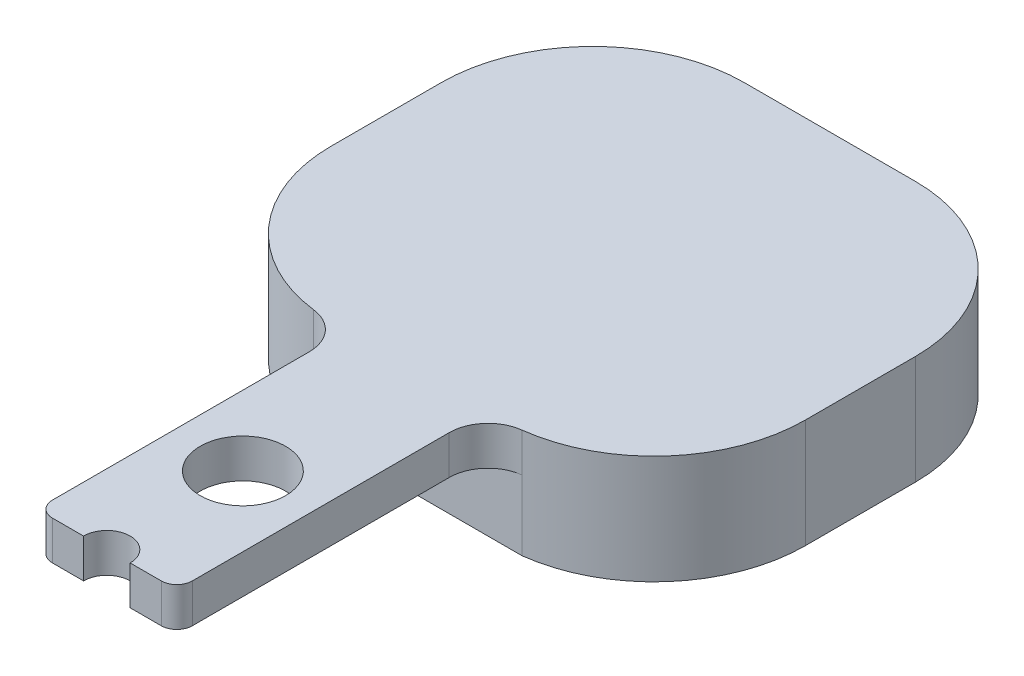
ISO-10303-21;
HEADER;
FILE_DESCRIPTION(('STEP AP214'),'2;1');
FILE_NAME('part.step','',(''),(''),'','','');
FILE_SCHEMA(('AUTOMOTIVE_DESIGN { 1 0 10303 214 1 1 1 1 }'));
ENDSEC;
DATA;
#1=APPLICATION_CONTEXT('core data for automotive mechanical design processes');
#2=APPLICATION_PROTOCOL_DEFINITION('international standard','automotive_design',2000,#1);
#3=PRODUCT_CONTEXT('',#1,'mechanical');
#4=PRODUCT('Part','Part','',(#3));
#5=PRODUCT_RELATED_PRODUCT_CATEGORY('part','',(#4));
#6=PRODUCT_DEFINITION_FORMATION('','',#4);
#7=PRODUCT_DEFINITION_CONTEXT('part definition',#1,'design');
#8=PRODUCT_DEFINITION('design','',#6,#7);
#9=PRODUCT_DEFINITION_SHAPE('','',#8);
#10=(LENGTH_UNIT() NAMED_UNIT(*) SI_UNIT(.MILLI.,.METRE.));
#11=(NAMED_UNIT(*) PLANE_ANGLE_UNIT() SI_UNIT($,.RADIAN.));
#12=(NAMED_UNIT(*) SI_UNIT($,.STERADIAN.) SOLID_ANGLE_UNIT());
#13=UNCERTAINTY_MEASURE_WITH_UNIT(LENGTH_MEASURE(1.E-05),#10,'distance_accuracy_value','');
#14=(GEOMETRIC_REPRESENTATION_CONTEXT(3) GLOBAL_UNCERTAINTY_ASSIGNED_CONTEXT((#13)) GLOBAL_UNIT_ASSIGNED_CONTEXT((#10,
#11,#12)) REPRESENTATION_CONTEXT('',''));
#15=CARTESIAN_POINT('',(0.,0.,0.));
#16=DIRECTION('',(0.,0.,1.));
#17=DIRECTION('',(1.,0.,0.));
#18=AXIS2_PLACEMENT_3D('',#15,#16,#17);
#19=CARTESIAN_POINT('',(2.98004344828693,2.5,22.6380329202358));
#20=DIRECTION('',(0.,-1.,0.));
#21=DIRECTION('',(0.,0.,-1.));
#22=AXIS2_PLACEMENT_3D('',#19,#20,#21);
#23=CYLINDRICAL_SURFACE('',#22,2.75);
#24=CARTESIAN_POINT('',(2.98004344828693,2.5,22.6380329202358));
#25=DIRECTION('',(0.,1.,0.));
#26=DIRECTION('',(1.,0.,0.));
#27=AXIS2_PLACEMENT_3D('',#24,#25,#26);
#28=CIRCLE('',#27,2.75);
#29=CARTESIAN_POINT('',(5.73004344828693,2.5,22.6380329202358));
#30=VERTEX_POINT('',#29);
#31=EDGE_CURVE('E11',#30,#30,#28,.T.);
#32=ORIENTED_EDGE('',*,*,#31,.T.);
#33=EDGE_LOOP('',(#32));
#34=FACE_BOUND('',#33,.T.);
#35=CARTESIAN_POINT('',(2.98004344828693,0.,22.6380329202358));
#36=DIRECTION('',(0.,1.,0.));
#37=DIRECTION('',(1.,0.,0.));
#38=AXIS2_PLACEMENT_3D('',#35,#36,#37);
#39=CIRCLE('',#38,2.75);
#40=CARTESIAN_POINT('',(5.73004344828693,0.,22.6380329202358));
#41=VERTEX_POINT('',#40);
#42=EDGE_CURVE('E236',#41,#41,#39,.T.);
#43=ORIENTED_EDGE('',*,*,#42,.F.);
#44=EDGE_LOOP('',(#43));
#45=FACE_BOUND('',#44,.T.);
#46=ADVANCED_FACE('F16',(#34,#45),#23,.F.);
#47=CARTESIAN_POINT('',(2.98004344828693,2.5,31.3880329202358));
#48=DIRECTION('',(0.,-1.,0.));
#49=DIRECTION('',(0.,0.,-1.));
#50=AXIS2_PLACEMENT_3D('',#47,#48,#49);
#51=CYLINDRICAL_SURFACE('',#50,1.5);
#52=CARTESIAN_POINT('',(2.98004344828693,2.5,31.3880329202358));
#53=DIRECTION('',(0.,-1.,0.));
#54=DIRECTION('',(0.,0.,-1.));
#55=AXIS2_PLACEMENT_3D('',#52,#53,#54);
#56=CIRCLE('',#55,1.5);
#57=CARTESIAN_POINT('',(1.48004344828693,2.5,31.3880329202358));
#58=VERTEX_POINT('',#57);
#59=CARTESIAN_POINT('',(4.48004344828693,2.5,31.3880329202358));
#60=VERTEX_POINT('',#59);
#61=EDGE_CURVE('E35',#58,#60,#56,.T.);
#62=ORIENTED_EDGE('',*,*,#61,.F.);
#63=DIRECTION('',(0.,-1.,0.));
#64=VECTOR('',#63,1.);
#65=CARTESIAN_POINT('',(1.48004344828693,2.5,31.3880329202358));
#66=LINE('',#65,#64);
#67=CARTESIAN_POINT('',(1.48004344828693,0.,31.3880329202358));
#68=VERTEX_POINT('',#67);
#69=EDGE_CURVE('E26',#58,#68,#66,.T.);
#70=ORIENTED_EDGE('',*,*,#69,.T.);
#71=CARTESIAN_POINT('',(2.98004344828693,0.,31.3880329202358));
#72=DIRECTION('',(0.,-1.,0.));
#73=DIRECTION('',(0.,0.,-1.));
#74=AXIS2_PLACEMENT_3D('',#71,#72,#73);
#75=CIRCLE('',#74,1.5);
#76=CARTESIAN_POINT('',(4.48004344828693,0.,31.3880329202358));
#77=VERTEX_POINT('',#76);
#78=EDGE_CURVE('E308',#68,#77,#75,.T.);
#79=ORIENTED_EDGE('',*,*,#78,.T.);
#80=DIRECTION('',(0.,-1.,0.));
#81=VECTOR('',#80,1.);
#82=CARTESIAN_POINT('',(4.48004344828693,2.5,31.3880329202358));
#83=LINE('',#82,#81);
#84=EDGE_CURVE('E205',#60,#77,#83,.T.);
#85=ORIENTED_EDGE('',*,*,#84,.F.);
#86=EDGE_LOOP('',(#62,#70,#79,#85));
#87=FACE_BOUND('',#86,.T.);
#88=ADVANCED_FACE('F18',(#87),#51,.F.);
#89=CARTESIAN_POINT('',(-0.519956551713071,0.,30.3880329202358));
#90=DIRECTION('',(0.,1.,0.));
#91=DIRECTION('',(0.,0.,1.));
#92=AXIS2_PLACEMENT_3D('',#89,#90,#91);
#93=PLANE('',#92);
#94=DIRECTION('',(-1.,0.,0.));
#95=VECTOR('',#94,1.);
#96=CARTESIAN_POINT('',(-3.71383410273348,0.,11.3880329202358));
#97=LINE('',#96,#95);
#98=CARTESIAN_POINT('',(9.67392099930734,0.,11.3880329202358));
#99=VERTEX_POINT('',#98);
#100=CARTESIAN_POINT('',(-3.71383410273348,0.,11.3880329202358));
#101=VERTEX_POINT('',#100);
#102=EDGE_CURVE('E154',#99,#101,#97,.T.);
#103=ORIENTED_EDGE('',*,*,#102,.F.);
#104=CARTESIAN_POINT('',(9.98004344828693,0.,13.869219943866));
#105=DIRECTION('',(0.,-1.,0.));
#106=DIRECTION('',(0.,0.,-1.));
#107=AXIS2_PLACEMENT_3D('',#104,#105,#106);
#108=CIRCLE('',#107,2.5);
#109=CARTESIAN_POINT('',(7.48004344828693,0.,13.869219943866));
#110=VERTEX_POINT('',#109);
#111=EDGE_CURVE('E207',#110,#99,#108,.T.);
#112=ORIENTED_EDGE('',*,*,#111,.F.);
#113=DIRECTION('',(0.,0.,-1.));
#114=VECTOR('',#113,1.);
#115=CARTESIAN_POINT('',(7.48004344828693,0.,30.3880329202358));
#116=LINE('',#115,#114);
#117=CARTESIAN_POINT('',(7.48004344828693,0.,30.3880329202358));
#118=VERTEX_POINT('',#117);
#119=EDGE_CURVE('E212',#118,#110,#116,.T.);
#120=ORIENTED_EDGE('',*,*,#119,.F.);
#121=CARTESIAN_POINT('',(6.48004344828693,0.,30.3880329202358));
#122=DIRECTION('',(0.,1.,0.));
#123=DIRECTION('',(1.,0.,0.));
#124=AXIS2_PLACEMENT_3D('',#121,#122,#123);
#125=CIRCLE('',#124,1.);
#126=CARTESIAN_POINT('',(6.48004344828693,0.,31.3880329202358));
#127=VERTEX_POINT('',#126);
#128=EDGE_CURVE('E216',#127,#118,#125,.T.);
#129=ORIENTED_EDGE('',*,*,#128,.F.);
#130=DIRECTION('',(1.,0.,0.));
#131=VECTOR('',#130,1.);
#132=CARTESIAN_POINT('',(4.48004344828693,0.,31.3880329202358));
#133=LINE('',#132,#131);
#134=EDGE_CURVE('E219',#77,#127,#133,.T.);
#135=ORIENTED_EDGE('',*,*,#134,.F.);
#136=ORIENTED_EDGE('',*,*,#78,.F.);
#137=DIRECTION('',(1.,0.,0.));
#138=VECTOR('',#137,1.);
#139=CARTESIAN_POINT('',(-0.519956551713071,0.,31.3880329202358));
#140=LINE('',#139,#138);
#141=CARTESIAN_POINT('',(-0.519956551713071,0.,31.3880329202358));
#142=VERTEX_POINT('',#141);
#143=EDGE_CURVE('E223',#142,#68,#140,.T.);
#144=ORIENTED_EDGE('',*,*,#143,.F.);
#145=CARTESIAN_POINT('',(-0.519956551713071,0.,30.3880329202358));
#146=DIRECTION('',(0.,1.,0.));
#147=DIRECTION('',(1.,0.,0.));
#148=AXIS2_PLACEMENT_3D('',#145,#146,#147);
#149=CIRCLE('',#148,1.);
#150=CARTESIAN_POINT('',(-1.51995655171307,0.,30.3880329202358));
#151=VERTEX_POINT('',#150);
#152=EDGE_CURVE('E227',#151,#142,#149,.T.);
#153=ORIENTED_EDGE('',*,*,#152,.F.);
#154=DIRECTION('',(0.,0.,1.));
#155=VECTOR('',#154,1.);
#156=CARTESIAN_POINT('',(-1.51995655171307,0.,13.869219943866));
#157=LINE('',#156,#155);
#158=CARTESIAN_POINT('',(-1.51995655171307,0.,13.869219943866));
#159=VERTEX_POINT('',#158);
#160=EDGE_CURVE('E196',#159,#151,#157,.T.);
#161=ORIENTED_EDGE('',*,*,#160,.F.);
#162=CARTESIAN_POINT('',(-4.01995655171307,0.,13.869219943866));
#163=DIRECTION('',(0.,-1.,0.));
#164=DIRECTION('',(0.,0.,-1.));
#165=AXIS2_PLACEMENT_3D('',#162,#163,#164);
#166=CIRCLE('',#165,2.5);
#167=EDGE_CURVE('E156',#101,#159,#166,.T.);
#168=ORIENTED_EDGE('',*,*,#167,.F.);
#169=EDGE_LOOP('',(#103,#112,#120,#129,#135,#136,#144,#153,#161,#168));
#170=FACE_BOUND('',#169,.T.);
#171=ORIENTED_EDGE('',*,*,#42,.T.);
#172=EDGE_LOOP('',(#171));
#173=FACE_BOUND('',#172,.T.);
#174=ADVANCED_FACE('F295',(#170,#173),#93,.F.);
#175=CARTESIAN_POINT('',(-0.519956551713071,2.5,30.3880329202358));
#176=DIRECTION('',(0.,1.,0.));
#177=DIRECTION('',(0.,0.,1.));
#178=AXIS2_PLACEMENT_3D('',#175,#176,#177);
#179=PLANE('',#178);
#180=CARTESIAN_POINT('',(-0.519956551713071,2.5,30.3880329202358));
#181=DIRECTION('',(0.,1.,0.));
#182=DIRECTION('',(1.,0.,0.));
#183=AXIS2_PLACEMENT_3D('',#180,#181,#182);
#184=CIRCLE('',#183,1.);
#185=CARTESIAN_POINT('',(-1.51995655171307,2.5,30.3880329202358));
#186=VERTEX_POINT('',#185);
#187=CARTESIAN_POINT('',(-0.519956551713071,2.5,31.3880329202358));
#188=VERTEX_POINT('',#187);
#189=EDGE_CURVE('E233',#186,#188,#184,.T.);
#190=ORIENTED_EDGE('',*,*,#189,.T.);
#191=DIRECTION('',(1.,0.,0.));
#192=VECTOR('',#191,1.);
#193=CARTESIAN_POINT('',(-0.519956551713071,2.5,31.3880329202358));
#194=LINE('',#193,#192);
#195=EDGE_CURVE('E237',#188,#58,#194,.T.);
#196=ORIENTED_EDGE('',*,*,#195,.T.);
#197=ORIENTED_EDGE('',*,*,#61,.T.);
#198=DIRECTION('',(1.,0.,0.));
#199=VECTOR('',#198,1.);
#200=CARTESIAN_POINT('',(4.48004344828693,2.5,31.3880329202358));
#201=LINE('',#200,#199);
#202=CARTESIAN_POINT('',(6.48004344828693,2.5,31.3880329202358));
#203=VERTEX_POINT('',#202);
#204=EDGE_CURVE('E240',#60,#203,#201,.T.);
#205=ORIENTED_EDGE('',*,*,#204,.T.);
#206=CARTESIAN_POINT('',(6.48004344828693,2.5,30.3880329202358));
#207=DIRECTION('',(0.,1.,0.));
#208=DIRECTION('',(1.,0.,0.));
#209=AXIS2_PLACEMENT_3D('',#206,#207,#208);
#210=CIRCLE('',#209,1.);
#211=CARTESIAN_POINT('',(7.48004344828693,2.5,30.3880329202358));
#212=VERTEX_POINT('',#211);
#213=EDGE_CURVE('E243',#203,#212,#210,.T.);
#214=ORIENTED_EDGE('',*,*,#213,.T.);
#215=DIRECTION('',(0.,0.,-1.));
#216=VECTOR('',#215,1.);
#217=CARTESIAN_POINT('',(7.48004344828693,2.5,30.3880329202358));
#218=LINE('',#217,#216);
#219=CARTESIAN_POINT('',(7.48004344828693,2.5,13.869219943866));
#220=VERTEX_POINT('',#219);
#221=EDGE_CURVE('E246',#212,#220,#218,.T.);
#222=ORIENTED_EDGE('',*,*,#221,.T.);
#223=CARTESIAN_POINT('',(9.98004344828693,2.5,13.869219943866));
#224=DIRECTION('',(0.,-1.,0.));
#225=DIRECTION('',(0.,0.,-1.));
#226=AXIS2_PLACEMENT_3D('',#223,#224,#225);
#227=CIRCLE('',#226,2.5);
#228=CARTESIAN_POINT('',(9.67392099930734,2.5,11.3880329202358));
#229=VERTEX_POINT('',#228);
#230=EDGE_CURVE('E249',#220,#229,#227,.T.);
#231=ORIENTED_EDGE('',*,*,#230,.T.);
#232=CARTESIAN_POINT('',(8.48004344828693,2.5,1.71140352807814));
#233=DIRECTION('',(0.,1.,0.));
#234=DIRECTION('',(1.,0.,0.));
#235=AXIS2_PLACEMENT_3D('',#232,#233,#234);
#236=CIRCLE('',#235,9.75);
#237=CARTESIAN_POINT('',(18.2300434482869,2.5,1.71140352807814));
#238=VERTEX_POINT('',#237);
#239=EDGE_CURVE('E252',#229,#238,#236,.T.);
#240=ORIENTED_EDGE('',*,*,#239,.T.);
#241=DIRECTION('',(0.,0.,-1.));
#242=VECTOR('',#241,1.);
#243=CARTESIAN_POINT('',(18.2300434482869,2.5,1.71140352807814));
#244=LINE('',#243,#242);
#245=CARTESIAN_POINT('',(18.2300434482869,2.5,-5.3619670797642));
#246=VERTEX_POINT('',#245);
#247=EDGE_CURVE('E255',#238,#246,#244,.T.);
#248=ORIENTED_EDGE('',*,*,#247,.T.);
#249=CARTESIAN_POINT('',(8.48004344828693,2.5,-5.3619670797642));
#250=DIRECTION('',(0.,1.,0.));
#251=DIRECTION('',(1.,0.,0.));
#252=AXIS2_PLACEMENT_3D('',#249,#250,#251);
#253=CIRCLE('',#252,9.75);
#254=CARTESIAN_POINT('',(8.48004344828693,2.5,-15.1119670797642));
#255=VERTEX_POINT('',#254);
#256=EDGE_CURVE('E258',#246,#255,#253,.T.);
#257=ORIENTED_EDGE('',*,*,#256,.T.);
#258=DIRECTION('',(-1.,0.,0.));
#259=VECTOR('',#258,1.);
#260=CARTESIAN_POINT('',(8.48004344828693,2.5,-15.1119670797642));
#261=LINE('',#260,#259);
#262=CARTESIAN_POINT('',(-2.51995655171307,2.5,-15.1119670797642));
#263=VERTEX_POINT('',#262);
#264=EDGE_CURVE('E261',#255,#263,#261,.T.);
#265=ORIENTED_EDGE('',*,*,#264,.T.);
#266=CARTESIAN_POINT('',(-2.51995655171307,2.5,-5.3619670797642));
#267=DIRECTION('',(0.,1.,0.));
#268=DIRECTION('',(1.,0.,0.));
#269=AXIS2_PLACEMENT_3D('',#266,#267,#268);
#270=CIRCLE('',#269,9.75);
#271=CARTESIAN_POINT('',(-12.2699565517131,2.5,-5.3619670797642));
#272=VERTEX_POINT('',#271);
#273=EDGE_CURVE('E264',#263,#272,#270,.T.);
#274=ORIENTED_EDGE('',*,*,#273,.T.);
#275=DIRECTION('',(0.,0.,1.));
#276=VECTOR('',#275,1.);
#277=CARTESIAN_POINT('',(-12.2699565517131,2.5,-5.3619670797642));
#278=LINE('',#277,#276);
#279=CARTESIAN_POINT('',(-12.2699565517131,2.5,1.71140352807814));
#280=VERTEX_POINT('',#279);
#281=EDGE_CURVE('E267',#272,#280,#278,.T.);
#282=ORIENTED_EDGE('',*,*,#281,.T.);
#283=CARTESIAN_POINT('',(-2.51995655171307,2.5,1.71140352807814));
#284=DIRECTION('',(0.,1.,0.));
#285=DIRECTION('',(1.,0.,0.));
#286=AXIS2_PLACEMENT_3D('',#283,#284,#285);
#287=CIRCLE('',#286,9.75);
#288=CARTESIAN_POINT('',(-3.71383410273348,2.5,11.3880329202358));
#289=VERTEX_POINT('',#288);
#290=EDGE_CURVE('E270',#280,#289,#287,.T.);
#291=ORIENTED_EDGE('',*,*,#290,.T.);
#292=CARTESIAN_POINT('',(-4.01995655171307,2.5,13.869219943866));
#293=DIRECTION('',(0.,-1.,0.));
#294=DIRECTION('',(0.,0.,-1.));
#295=AXIS2_PLACEMENT_3D('',#292,#293,#294);
#296=CIRCLE('',#295,2.5);
#297=CARTESIAN_POINT('',(-1.51995655171307,2.5,13.869219943866));
#298=VERTEX_POINT('',#297);
#299=EDGE_CURVE('E273',#289,#298,#296,.T.);
#300=ORIENTED_EDGE('',*,*,#299,.T.);
#301=DIRECTION('',(0.,0.,1.));
#302=VECTOR('',#301,1.);
#303=CARTESIAN_POINT('',(-1.51995655171307,2.5,13.869219943866));
#304=LINE('',#303,#302);
#305=EDGE_CURVE('E229',#298,#186,#304,.T.);
#306=ORIENTED_EDGE('',*,*,#305,.T.);
#307=EDGE_LOOP('',(#190,#196,#197,#205,#214,#222,#231,#240,#248,#257,#265,#274,#282,#291,#300,#306));
#308=FACE_BOUND('',#307,.T.);
#309=ORIENTED_EDGE('',*,*,#31,.F.);
#310=EDGE_LOOP('',(#309));
#311=FACE_BOUND('',#310,.T.);
#312=ADVANCED_FACE('F314',(#308,#311),#179,.T.);
#313=CARTESIAN_POINT('',(-0.519956551713071,2.5,30.3880329202358));
#314=DIRECTION('',(0.,-1.,0.));
#315=DIRECTION('',(0.,0.,-1.));
#316=AXIS2_PLACEMENT_3D('',#313,#314,#315);
#317=CYLINDRICAL_SURFACE('',#316,1.);
#318=ORIENTED_EDGE('',*,*,#152,.T.);
#319=DIRECTION('',(0.,-1.,0.));
#320=VECTOR('',#319,1.);
#321=CARTESIAN_POINT('',(-0.519956551713071,2.5,31.3880329202358));
#322=LINE('',#321,#320);
#323=EDGE_CURVE('E222',#188,#142,#322,.T.);
#324=ORIENTED_EDGE('',*,*,#323,.F.);
#325=ORIENTED_EDGE('',*,*,#189,.F.);
#326=DIRECTION('',(0.,-1.,0.));
#327=VECTOR('',#326,1.);
#328=CARTESIAN_POINT('',(-1.51995655171307,2.5,30.3880329202358));
#329=LINE('',#328,#327);
#330=EDGE_CURVE('E226',#186,#151,#329,.T.);
#331=ORIENTED_EDGE('',*,*,#330,.T.);
#332=EDGE_LOOP('',(#318,#324,#325,#331));
#333=FACE_BOUND('',#332,.T.);
#334=ADVANCED_FACE('F322',(#333),#317,.T.);
#335=CARTESIAN_POINT('',(-0.519956551713071,2.5,31.3880329202358));
#336=DIRECTION('',(0.,0.,-1.));
#337=DIRECTION('',(-1.,0.,0.));
#338=AXIS2_PLACEMENT_3D('',#335,#336,#337);
#339=PLANE('',#338);
#340=ORIENTED_EDGE('',*,*,#143,.T.);
#341=ORIENTED_EDGE('',*,*,#69,.F.);
#342=ORIENTED_EDGE('',*,*,#195,.F.);
#343=ORIENTED_EDGE('',*,*,#323,.T.);
#344=EDGE_LOOP('',(#340,#341,#342,#343));
#345=FACE_BOUND('',#344,.T.);
#346=ADVANCED_FACE('F319',(#345),#339,.F.);
#347=CARTESIAN_POINT('',(4.48004344828693,2.5,31.3880329202358));
#348=DIRECTION('',(0.,0.,-1.));
#349=DIRECTION('',(-1.,0.,0.));
#350=AXIS2_PLACEMENT_3D('',#347,#348,#349);
#351=PLANE('',#350);
#352=ORIENTED_EDGE('',*,*,#134,.T.);
#353=DIRECTION('',(0.,-1.,0.));
#354=VECTOR('',#353,1.);
#355=CARTESIAN_POINT('',(6.48004344828693,2.5,31.3880329202358));
#356=LINE('',#355,#354);
#357=EDGE_CURVE('E215',#203,#127,#356,.T.);
#358=ORIENTED_EDGE('',*,*,#357,.F.);
#359=ORIENTED_EDGE('',*,*,#204,.F.);
#360=ORIENTED_EDGE('',*,*,#84,.T.);
#361=EDGE_LOOP('',(#352,#358,#359,#360));
#362=FACE_BOUND('',#361,.T.);
#363=ADVANCED_FACE('F305',(#362),#351,.F.);
#364=CARTESIAN_POINT('',(6.48004344828693,2.5,30.3880329202358));
#365=DIRECTION('',(0.,-1.,0.));
#366=DIRECTION('',(0.,0.,-1.));
#367=AXIS2_PLACEMENT_3D('',#364,#365,#366);
#368=CYLINDRICAL_SURFACE('',#367,1.);
#369=ORIENTED_EDGE('',*,*,#128,.T.);
#370=DIRECTION('',(0.,-1.,0.));
#371=VECTOR('',#370,1.);
#372=CARTESIAN_POINT('',(7.48004344828693,2.5,30.3880329202358));
#373=LINE('',#372,#371);
#374=EDGE_CURVE('E210',#212,#118,#373,.T.);
#375=ORIENTED_EDGE('',*,*,#374,.F.);
#376=ORIENTED_EDGE('',*,*,#213,.F.);
#377=ORIENTED_EDGE('',*,*,#357,.T.);
#378=EDGE_LOOP('',(#369,#375,#376,#377));
#379=FACE_BOUND('',#378,.T.);
#380=ADVANCED_FACE('F301',(#379),#368,.T.);
#381=CARTESIAN_POINT('',(7.48004344828693,2.5,30.3880329202358));
#382=DIRECTION('',(-1.,0.,0.));
#383=DIRECTION('',(0.,0.,1.));
#384=AXIS2_PLACEMENT_3D('',#381,#382,#383);
#385=PLANE('',#384);
#386=ORIENTED_EDGE('',*,*,#119,.T.);
#387=DIRECTION('',(0.,-1.,0.));
#388=VECTOR('',#387,1.);
#389=CARTESIAN_POINT('',(7.48004344828693,2.5,13.869219943866));
#390=LINE('',#389,#388);
#391=EDGE_CURVE('E211',#220,#110,#390,.T.);
#392=ORIENTED_EDGE('',*,*,#391,.F.);
#393=ORIENTED_EDGE('',*,*,#221,.F.);
#394=ORIENTED_EDGE('',*,*,#374,.T.);
#395=EDGE_LOOP('',(#386,#392,#393,#394));
#396=FACE_BOUND('',#395,.T.);
#397=ADVANCED_FACE('F298',(#396),#385,.F.);
#398=CARTESIAN_POINT('',(9.98004344828693,2.5,13.869219943866));
#399=DIRECTION('',(0.,-1.,0.));
#400=DIRECTION('',(0.,0.,-1.));
#401=AXIS2_PLACEMENT_3D('',#398,#399,#400);
#402=CYLINDRICAL_SURFACE('',#401,2.5);
#403=ORIENTED_EDGE('',*,*,#111,.T.);
#404=DIRECTION('',(0.,-1.,0.));
#405=VECTOR('',#404,1.);
#406=CARTESIAN_POINT('',(9.67392099930734,2.5,11.3880329202358));
#407=LINE('',#406,#405);
#408=EDGE_CURVE('E170',#229,#99,#407,.T.);
#409=ORIENTED_EDGE('',*,*,#408,.F.);
#410=ORIENTED_EDGE('',*,*,#230,.F.);
#411=ORIENTED_EDGE('',*,*,#391,.T.);
#412=EDGE_LOOP('',(#403,#409,#410,#411));
#413=FACE_BOUND('',#412,.T.);
#414=ADVANCED_FACE('F292',(#413),#402,.F.);
#415=CARTESIAN_POINT('',(8.48004344828693,2.5,1.71140352807814));
#416=DIRECTION('',(0.,-1.,0.));
#417=DIRECTION('',(0.,0.,-1.));
#418=AXIS2_PLACEMENT_3D('',#415,#416,#417);
#419=CYLINDRICAL_SURFACE('',#418,9.75);
#420=ORIENTED_EDGE('',*,*,#408,.T.);
#421=DIRECTION('',(0.,1.,0.));
#422=VECTOR('',#421,1.);
#423=CARTESIAN_POINT('',(9.67392099930734,-4.5,11.3880329202358));
#424=LINE('',#423,#422);
#425=CARTESIAN_POINT('',(9.67392099930734,-4.5,11.3880329202358));
#426=VERTEX_POINT('',#425);
#427=EDGE_CURVE('E162',#426,#99,#424,.T.);
#428=ORIENTED_EDGE('',*,*,#427,.F.);
#429=CARTESIAN_POINT('',(8.48004344828693,-4.5,1.71140352807814));
#430=DIRECTION('',(0.,-1.,0.));
#431=DIRECTION('',(0.,0.,-1.));
#432=AXIS2_PLACEMENT_3D('',#429,#430,#431);
#433=CIRCLE('',#432,9.75);
#434=CARTESIAN_POINT('',(18.2300434482869,-4.5,1.71140352807814));
#435=VERTEX_POINT('',#434);
#436=EDGE_CURVE('E160',#435,#426,#433,.T.);
#437=ORIENTED_EDGE('',*,*,#436,.F.);
#438=DIRECTION('',(0.,-1.,0.));
#439=VECTOR('',#438,1.);
#440=CARTESIAN_POINT('',(18.2300434482869,2.5,1.71140352807814));
#441=LINE('',#440,#439);
#442=EDGE_CURVE('E167',#238,#435,#441,.T.);
#443=ORIENTED_EDGE('',*,*,#442,.F.);
#444=ORIENTED_EDGE('',*,*,#239,.F.);
#445=EDGE_LOOP('',(#420,#428,#437,#443,#444));
#446=FACE_BOUND('',#445,.T.);
#447=ADVANCED_FACE('F289',(#446),#419,.T.);
#448=CARTESIAN_POINT('',(18.2300434482869,2.5,1.71140352807814));
#449=DIRECTION('',(-1.,0.,0.));
#450=DIRECTION('',(0.,0.,1.));
#451=AXIS2_PLACEMENT_3D('',#448,#449,#450);
#452=PLANE('',#451);
#453=ORIENTED_EDGE('',*,*,#442,.T.);
#454=DIRECTION('',(0.,0.,1.));
#455=VECTOR('',#454,1.);
#456=CARTESIAN_POINT('',(18.2300434482869,-4.5,1.71140352807814));
#457=LINE('',#456,#455);
#458=CARTESIAN_POINT('',(18.2300434482869,-4.5,-5.3619670797642));
#459=VERTEX_POINT('',#458);
#460=EDGE_CURVE('E172',#459,#435,#457,.T.);
#461=ORIENTED_EDGE('',*,*,#460,.F.);
#462=DIRECTION('',(0.,-1.,0.));
#463=VECTOR('',#462,1.);
#464=CARTESIAN_POINT('',(18.2300434482869,2.5,-5.3619670797642));
#465=LINE('',#464,#463);
#466=EDGE_CURVE('E171',#246,#459,#465,.T.);
#467=ORIENTED_EDGE('',*,*,#466,.F.);
#468=ORIENTED_EDGE('',*,*,#247,.F.);
#469=EDGE_LOOP('',(#453,#461,#467,#468));
#470=FACE_BOUND('',#469,.T.);
#471=ADVANCED_FACE('F362',(#470),#452,.F.);
#472=CARTESIAN_POINT('',(8.48004344828693,2.5,-5.3619670797642));
#473=DIRECTION('',(0.,-1.,0.));
#474=DIRECTION('',(0.,0.,-1.));
#475=AXIS2_PLACEMENT_3D('',#472,#473,#474);
#476=CYLINDRICAL_SURFACE('',#475,9.75);
#477=ORIENTED_EDGE('',*,*,#466,.T.);
#478=CARTESIAN_POINT('',(8.48004344828693,-4.5,-5.3619670797642));
#479=DIRECTION('',(0.,-1.,0.));
#480=DIRECTION('',(0.,0.,-1.));
#481=AXIS2_PLACEMENT_3D('',#478,#479,#480);
#482=CIRCLE('',#481,9.75);
#483=CARTESIAN_POINT('',(8.48004344828693,-4.5,-15.1119670797642));
#484=VERTEX_POINT('',#483);
#485=EDGE_CURVE('E174',#484,#459,#482,.T.);
#486=ORIENTED_EDGE('',*,*,#485,.F.);
#487=DIRECTION('',(0.,-1.,0.));
#488=VECTOR('',#487,1.);
#489=CARTESIAN_POINT('',(8.48004344828693,2.5,-15.1119670797642));
#490=LINE('',#489,#488);
#491=EDGE_CURVE('E177',#255,#484,#490,.T.);
#492=ORIENTED_EDGE('',*,*,#491,.F.);
#493=ORIENTED_EDGE('',*,*,#256,.F.);
#494=EDGE_LOOP('',(#477,#486,#492,#493));
#495=FACE_BOUND('',#494,.T.);
#496=ADVANCED_FACE('F359',(#495),#476,.T.);
#497=CARTESIAN_POINT('',(8.48004344828693,2.5,-15.1119670797642));
#498=DIRECTION('',(0.,0.,1.));
#499=DIRECTION('',(1.,0.,0.));
#500=AXIS2_PLACEMENT_3D('',#497,#498,#499);
#501=PLANE('',#500);
#502=ORIENTED_EDGE('',*,*,#491,.T.);
#503=DIRECTION('',(1.,0.,0.));
#504=VECTOR('',#503,1.);
#505=CARTESIAN_POINT('',(8.48004344828693,-4.5,-15.1119670797642));
#506=LINE('',#505,#504);
#507=CARTESIAN_POINT('',(-2.51995655171307,-4.5,-15.1119670797642));
#508=VERTEX_POINT('',#507);
#509=EDGE_CURVE('E180',#508,#484,#506,.T.);
#510=ORIENTED_EDGE('',*,*,#509,.F.);
#511=DIRECTION('',(0.,-1.,0.));
#512=VECTOR('',#511,1.);
#513=CARTESIAN_POINT('',(-2.51995655171307,2.5,-15.1119670797642));
#514=LINE('',#513,#512);
#515=EDGE_CURVE('E183',#263,#508,#514,.T.);
#516=ORIENTED_EDGE('',*,*,#515,.F.);
#517=ORIENTED_EDGE('',*,*,#264,.F.);
#518=EDGE_LOOP('',(#502,#510,#516,#517));
#519=FACE_BOUND('',#518,.T.);
#520=ADVANCED_FACE('F338',(#519),#501,.F.);
#521=CARTESIAN_POINT('',(-2.51995655171307,2.5,-5.3619670797642));
#522=DIRECTION('',(0.,-1.,0.));
#523=DIRECTION('',(0.,0.,-1.));
#524=AXIS2_PLACEMENT_3D('',#521,#522,#523);
#525=CYLINDRICAL_SURFACE('',#524,9.75);
#526=ORIENTED_EDGE('',*,*,#515,.T.);
#527=CARTESIAN_POINT('',(-2.51995655171307,-4.5,-5.3619670797642));
#528=DIRECTION('',(0.,-1.,0.));
#529=DIRECTION('',(0.,0.,-1.));
#530=AXIS2_PLACEMENT_3D('',#527,#528,#529);
#531=CIRCLE('',#530,9.75);
#532=CARTESIAN_POINT('',(-12.2699565517131,-4.5,-5.3619670797642));
#533=VERTEX_POINT('',#532);
#534=EDGE_CURVE('E186',#533,#508,#531,.T.);
#535=ORIENTED_EDGE('',*,*,#534,.F.);
#536=DIRECTION('',(0.,-1.,0.));
#537=VECTOR('',#536,1.);
#538=CARTESIAN_POINT('',(-12.2699565517131,2.5,-5.3619670797642));
#539=LINE('',#538,#537);
#540=EDGE_CURVE('E189',#272,#533,#539,.T.);
#541=ORIENTED_EDGE('',*,*,#540,.F.);
#542=ORIENTED_EDGE('',*,*,#273,.F.);
#543=EDGE_LOOP('',(#526,#535,#541,#542));
#544=FACE_BOUND('',#543,.T.);
#545=ADVANCED_FACE('F330',(#544),#525,.T.);
#546=CARTESIAN_POINT('',(-12.2699565517131,2.5,-5.3619670797642));
#547=DIRECTION('',(1.,0.,0.));
#548=DIRECTION('',(0.,0.,-1.));
#549=AXIS2_PLACEMENT_3D('',#546,#547,#548);
#550=PLANE('',#549);
#551=ORIENTED_EDGE('',*,*,#540,.T.);
#552=DIRECTION('',(0.,0.,-1.));
#553=VECTOR('',#552,1.);
#554=CARTESIAN_POINT('',(-12.2699565517131,-4.5,-5.3619670797642));
#555=LINE('',#554,#553);
#556=CARTESIAN_POINT('',(-12.2699565517131,-4.5,1.71140352807814));
#557=VERTEX_POINT('',#556);
#558=EDGE_CURVE('E134',#557,#533,#555,.T.);
#559=ORIENTED_EDGE('',*,*,#558,.F.);
#560=DIRECTION('',(0.,-1.,0.));
#561=VECTOR('',#560,1.);
#562=CARTESIAN_POINT('',(-12.2699565517131,2.5,1.71140352807814));
#563=LINE('',#562,#561);
#564=EDGE_CURVE('E146',#280,#557,#563,.T.);
#565=ORIENTED_EDGE('',*,*,#564,.F.);
#566=ORIENTED_EDGE('',*,*,#281,.F.);
#567=EDGE_LOOP('',(#551,#559,#565,#566));
#568=FACE_BOUND('',#567,.T.);
#569=ADVANCED_FACE('F328',(#568),#550,.F.);
#570=CARTESIAN_POINT('',(-2.51995655171307,2.5,1.71140352807814));
#571=DIRECTION('',(0.,-1.,0.));
#572=DIRECTION('',(0.,0.,-1.));
#573=AXIS2_PLACEMENT_3D('',#570,#571,#572);
#574=CYLINDRICAL_SURFACE('',#573,9.75);
#575=ORIENTED_EDGE('',*,*,#564,.T.);
#576=CARTESIAN_POINT('',(-2.51995655171307,-4.5,1.71140352807814));
#577=DIRECTION('',(0.,-1.,0.));
#578=DIRECTION('',(0.,0.,-1.));
#579=AXIS2_PLACEMENT_3D('',#576,#577,#578);
#580=CIRCLE('',#579,9.75);
#581=CARTESIAN_POINT('',(-3.71383410273348,-4.5,11.3880329202358));
#582=VERTEX_POINT('',#581);
#583=EDGE_CURVE('E140',#582,#557,#580,.T.);
#584=ORIENTED_EDGE('',*,*,#583,.F.);
#585=DIRECTION('',(0.,1.,0.));
#586=VECTOR('',#585,1.);
#587=CARTESIAN_POINT('',(-3.71383410273348,-4.5,11.3880329202358));
#588=LINE('',#587,#586);
#589=EDGE_CURVE('E144',#582,#101,#588,.T.);
#590=ORIENTED_EDGE('',*,*,#589,.T.);
#591=DIRECTION('',(0.,-1.,0.));
#592=VECTOR('',#591,1.);
#593=CARTESIAN_POINT('',(-3.71383410273348,2.5,11.3880329202358));
#594=LINE('',#593,#592);
#595=EDGE_CURVE('E195',#289,#101,#594,.T.);
#596=ORIENTED_EDGE('',*,*,#595,.F.);
#597=ORIENTED_EDGE('',*,*,#290,.F.);
#598=EDGE_LOOP('',(#575,#584,#590,#596,#597));
#599=FACE_BOUND('',#598,.T.);
#600=ADVANCED_FACE('F142',(#599),#574,.T.);
#601=CARTESIAN_POINT('',(-4.01995655171307,2.5,13.869219943866));
#602=DIRECTION('',(0.,-1.,0.));
#603=DIRECTION('',(0.,0.,-1.));
#604=AXIS2_PLACEMENT_3D('',#601,#602,#603);
#605=CYLINDRICAL_SURFACE('',#604,2.5);
#606=ORIENTED_EDGE('',*,*,#167,.T.);
#607=DIRECTION('',(0.,-1.,0.));
#608=VECTOR('',#607,1.);
#609=CARTESIAN_POINT('',(-1.51995655171307,2.5,13.869219943866));
#610=LINE('',#609,#608);
#611=EDGE_CURVE('E197',#298,#159,#610,.T.);
#612=ORIENTED_EDGE('',*,*,#611,.F.);
#613=ORIENTED_EDGE('',*,*,#299,.F.);
#614=ORIENTED_EDGE('',*,*,#595,.T.);
#615=EDGE_LOOP('',(#606,#612,#613,#614));
#616=FACE_BOUND('',#615,.T.);
#617=ADVANCED_FACE('F326',(#616),#605,.F.);
#618=CARTESIAN_POINT('',(-1.51995655171307,2.5,13.869219943866));
#619=DIRECTION('',(1.,0.,0.));
#620=DIRECTION('',(0.,0.,-1.));
#621=AXIS2_PLACEMENT_3D('',#618,#619,#620);
#622=PLANE('',#621);
#623=ORIENTED_EDGE('',*,*,#160,.T.);
#624=ORIENTED_EDGE('',*,*,#330,.F.);
#625=ORIENTED_EDGE('',*,*,#305,.F.);
#626=ORIENTED_EDGE('',*,*,#611,.T.);
#627=EDGE_LOOP('',(#623,#624,#625,#626));
#628=FACE_BOUND('',#627,.T.);
#629=ADVANCED_FACE('F324',(#628),#622,.F.);
#630=CARTESIAN_POINT('',(-3.71383410273348,-4.5,11.3880329202358));
#631=DIRECTION('',(0.,0.,-1.));
#632=DIRECTION('',(-1.,0.,0.));
#633=AXIS2_PLACEMENT_3D('',#630,#631,#632);
#634=PLANE('',#633);
#635=ORIENTED_EDGE('',*,*,#102,.T.);
#636=ORIENTED_EDGE('',*,*,#589,.F.);
#637=DIRECTION('',(-1.,0.,0.));
#638=VECTOR('',#637,1.);
#639=CARTESIAN_POINT('',(-3.71383410273348,-4.5,11.3880329202358));
#640=LINE('',#639,#638);
#641=EDGE_CURVE('E20',#426,#582,#640,.T.);
#642=ORIENTED_EDGE('',*,*,#641,.F.);
#643=ORIENTED_EDGE('',*,*,#427,.T.);
#644=EDGE_LOOP('',(#635,#636,#642,#643));
#645=FACE_BOUND('',#644,.T.);
#646=ADVANCED_FACE('F152',(#645),#634,.F.);
#647=CARTESIAN_POINT('',(8.48004344828693,-4.5,1.71140352807814));
#648=DIRECTION('',(0.,-1.,0.));
#649=DIRECTION('',(0.,0.,-1.));
#650=AXIS2_PLACEMENT_3D('',#647,#648,#649);
#651=PLANE('',#650);
#652=ORIENTED_EDGE('',*,*,#436,.T.);
#653=ORIENTED_EDGE('',*,*,#641,.T.);
#654=ORIENTED_EDGE('',*,*,#583,.T.);
#655=ORIENTED_EDGE('',*,*,#558,.T.);
#656=ORIENTED_EDGE('',*,*,#534,.T.);
#657=ORIENTED_EDGE('',*,*,#509,.T.);
#658=ORIENTED_EDGE('',*,*,#485,.T.);
#659=ORIENTED_EDGE('',*,*,#460,.T.);
#660=EDGE_LOOP('',(#652,#653,#654,#655,#656,#657,#658,#659));
#661=FACE_BOUND('',#660,.T.);
#662=ADVANCED_FACE('F158',(#661),#651,.T.);
#663=CLOSED_SHELL('',(#46,#88,#174,#312,#334,#346,#363,#380,#397,#414,#447,#471,#496,#520,#545,
#569,#600,#617,#629,#646,#662));
#664=MANIFOLD_SOLID_BREP('B1',#663);
#665=ADVANCED_BREP_SHAPE_REPRESENTATION('',(#18,#664),#14);
#666=SHAPE_DEFINITION_REPRESENTATION(#9,#665);
ENDSEC;
END-ISO-10303-21;
